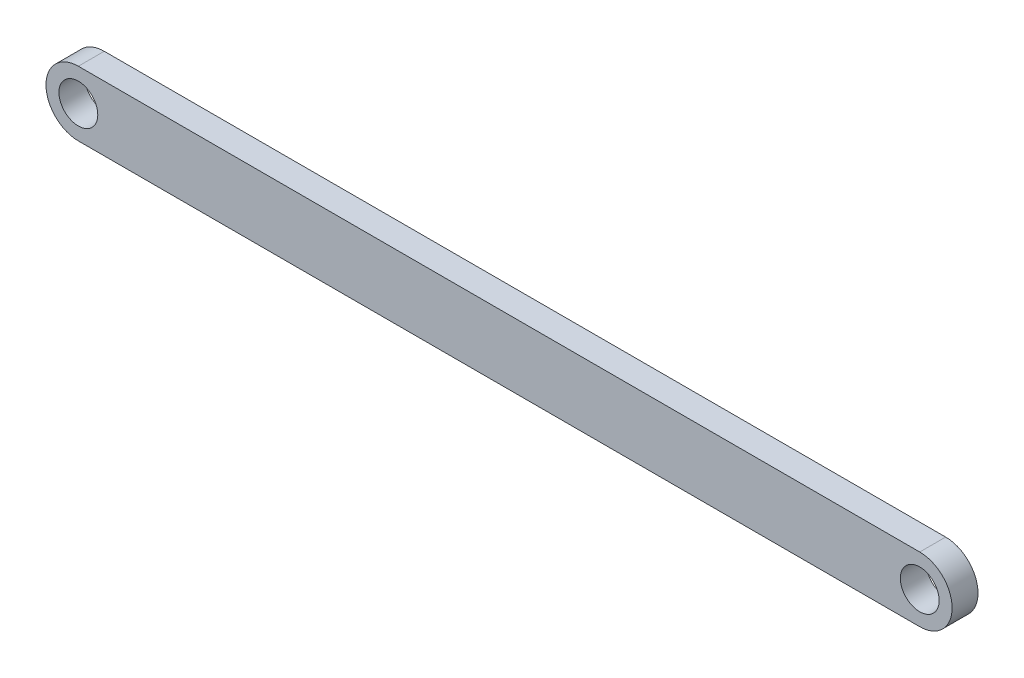
ISO-10303-21;
HEADER;
FILE_DESCRIPTION(('STEP AP214'),'2;1');
FILE_NAME('part.step','',(''),(''),'','','');
FILE_SCHEMA(('AUTOMOTIVE_DESIGN { 1 0 10303 214 1 1 1 1 }'));
ENDSEC;
DATA;
#1=APPLICATION_CONTEXT('core data for automotive mechanical design processes');
#2=APPLICATION_PROTOCOL_DEFINITION('international standard','automotive_design',2000,#1);
#3=PRODUCT_CONTEXT('',#1,'mechanical');
#4=PRODUCT('Part','Part','',(#3));
#5=PRODUCT_RELATED_PRODUCT_CATEGORY('part','',(#4));
#6=PRODUCT_DEFINITION_FORMATION('','',#4);
#7=PRODUCT_DEFINITION_CONTEXT('part definition',#1,'design');
#8=PRODUCT_DEFINITION('design','',#6,#7);
#9=PRODUCT_DEFINITION_SHAPE('','',#8);
#10=(LENGTH_UNIT() NAMED_UNIT(*) SI_UNIT(.MILLI.,.METRE.));
#11=(NAMED_UNIT(*) PLANE_ANGLE_UNIT() SI_UNIT($,.RADIAN.));
#12=(NAMED_UNIT(*) SI_UNIT($,.STERADIAN.) SOLID_ANGLE_UNIT());
#13=UNCERTAINTY_MEASURE_WITH_UNIT(LENGTH_MEASURE(1.E-05),#10,'distance_accuracy_value','');
#14=(GEOMETRIC_REPRESENTATION_CONTEXT(3) GLOBAL_UNCERTAINTY_ASSIGNED_CONTEXT((#13)) GLOBAL_UNIT_ASSIGNED_CONTEXT((#10,
#11,#12)) REPRESENTATION_CONTEXT('',''));
#15=CARTESIAN_POINT('',(0.,0.,0.));
#16=DIRECTION('',(0.,0.,1.));
#17=DIRECTION('',(1.,0.,0.));
#18=AXIS2_PLACEMENT_3D('',#15,#16,#17);
#19=CARTESIAN_POINT('',(0.,0.,2.));
#20=DIRECTION('',(0.,0.,1.));
#21=DIRECTION('',(1.,0.,0.));
#22=AXIS2_PLACEMENT_3D('',#19,#20,#21);
#23=PLANE('',#22);
#24=CARTESIAN_POINT('',(-65.,0.,2.));
#25=DIRECTION('',(0.,0.,1.));
#26=DIRECTION('',(1.,0.,0.));
#27=AXIS2_PLACEMENT_3D('',#24,#25,#26);
#28=CIRCLE('',#27,1.5);
#29=CARTESIAN_POINT('',(-63.5,0.,2.));
#30=VERTEX_POINT('',#29);
#31=EDGE_CURVE('E101',#30,#30,#28,.T.);
#32=ORIENTED_EDGE('',*,*,#31,.F.);
#33=EDGE_LOOP('',(#32));
#34=FACE_BOUND('',#33,.T.);
#35=CARTESIAN_POINT('',(0.,0.,2.));
#36=DIRECTION('',(0.,0.,1.));
#37=DIRECTION('',(1.,0.,0.));
#38=AXIS2_PLACEMENT_3D('',#35,#36,#37);
#39=CIRCLE('',#38,2.5);
#40=CARTESIAN_POINT('',(0.,-2.5,2.));
#41=VERTEX_POINT('',#40);
#42=CARTESIAN_POINT('',(0.,2.5,2.));
#43=VERTEX_POINT('',#42);
#44=EDGE_CURVE('E86',#41,#43,#39,.T.);
#45=ORIENTED_EDGE('',*,*,#44,.T.);
#46=DIRECTION('',(-1.,0.,0.));
#47=VECTOR('',#46,1.);
#48=CARTESIAN_POINT('',(0.,2.5,2.));
#49=LINE('',#48,#47);
#50=CARTESIAN_POINT('',(-65.,2.49999999999999,2.));
#51=VERTEX_POINT('',#50);
#52=EDGE_CURVE('E81',#43,#51,#49,.T.);
#53=ORIENTED_EDGE('',*,*,#52,.T.);
#54=CARTESIAN_POINT('',(-65.,0.,2.));
#55=DIRECTION('',(0.,0.,1.));
#56=DIRECTION('',(1.,0.,0.));
#57=AXIS2_PLACEMENT_3D('',#54,#55,#56);
#58=CIRCLE('',#57,2.5);
#59=CARTESIAN_POINT('',(-65.,-2.50000000000001,2.));
#60=VERTEX_POINT('',#59);
#61=EDGE_CURVE('E84',#51,#60,#58,.T.);
#62=ORIENTED_EDGE('',*,*,#61,.T.);
#63=DIRECTION('',(1.,0.,0.));
#64=VECTOR('',#63,1.);
#65=CARTESIAN_POINT('',(0.,-2.5,2.));
#66=LINE('',#65,#64);
#67=EDGE_CURVE('E51',#60,#41,#66,.T.);
#68=ORIENTED_EDGE('',*,*,#67,.T.);
#69=EDGE_LOOP('',(#45,#53,#62,#68));
#70=FACE_BOUND('',#69,.T.);
#71=CARTESIAN_POINT('',(0.,0.,2.));
#72=DIRECTION('',(0.,0.,1.));
#73=DIRECTION('',(1.,0.,0.));
#74=AXIS2_PLACEMENT_3D('',#71,#72,#73);
#75=CIRCLE('',#74,1.5);
#76=CARTESIAN_POINT('',(1.5,0.,2.));
#77=VERTEX_POINT('',#76);
#78=EDGE_CURVE('E116',#77,#77,#75,.T.);
#79=ORIENTED_EDGE('',*,*,#78,.F.);
#80=EDGE_LOOP('',(#79));
#81=FACE_BOUND('',#80,.T.);
#82=ADVANCED_FACE('F34',(#34,#70,#81),#23,.T.);
#83=CARTESIAN_POINT('',(0.,0.,0.));
#84=DIRECTION('',(0.,0.,1.));
#85=DIRECTION('',(1.,0.,0.));
#86=AXIS2_PLACEMENT_3D('',#83,#84,#85);
#87=PLANE('',#86);
#88=CARTESIAN_POINT('',(0.,0.,0.));
#89=DIRECTION('',(0.,0.,1.));
#90=DIRECTION('',(1.,0.,0.));
#91=AXIS2_PLACEMENT_3D('',#88,#89,#90);
#92=CIRCLE('',#91,2.5);
#93=CARTESIAN_POINT('',(0.,-2.5,0.));
#94=VERTEX_POINT('',#93);
#95=CARTESIAN_POINT('',(0.,2.5,0.));
#96=VERTEX_POINT('',#95);
#97=EDGE_CURVE('E98',#94,#96,#92,.T.);
#98=ORIENTED_EDGE('',*,*,#97,.F.);
#99=DIRECTION('',(1.,0.,0.));
#100=VECTOR('',#99,1.);
#101=CARTESIAN_POINT('',(0.,-2.5,0.));
#102=LINE('',#101,#100);
#103=CARTESIAN_POINT('',(-65.,-2.50000000000001,0.));
#104=VERTEX_POINT('',#103);
#105=EDGE_CURVE('E74',#104,#94,#102,.T.);
#106=ORIENTED_EDGE('',*,*,#105,.F.);
#107=CARTESIAN_POINT('',(-65.,0.,0.));
#108=DIRECTION('',(0.,0.,1.));
#109=DIRECTION('',(1.,0.,0.));
#110=AXIS2_PLACEMENT_3D('',#107,#108,#109);
#111=CIRCLE('',#110,2.5);
#112=CARTESIAN_POINT('',(-65.,2.49999999999999,0.));
#113=VERTEX_POINT('',#112);
#114=EDGE_CURVE('E68',#113,#104,#111,.T.);
#115=ORIENTED_EDGE('',*,*,#114,.F.);
#116=DIRECTION('',(-1.,0.,0.));
#117=VECTOR('',#116,1.);
#118=CARTESIAN_POINT('',(0.,2.5,0.));
#119=LINE('',#118,#117);
#120=EDGE_CURVE('E90',#96,#113,#119,.T.);
#121=ORIENTED_EDGE('',*,*,#120,.F.);
#122=EDGE_LOOP('',(#98,#106,#115,#121));
#123=FACE_BOUND('',#122,.T.);
#124=CARTESIAN_POINT('',(-65.,0.,0.));
#125=DIRECTION('',(0.,0.,1.));
#126=DIRECTION('',(1.,0.,0.));
#127=AXIS2_PLACEMENT_3D('',#124,#125,#126);
#128=CIRCLE('',#127,1.5);
#129=CARTESIAN_POINT('',(-63.5,0.,0.));
#130=VERTEX_POINT('',#129);
#131=EDGE_CURVE('E113',#130,#130,#128,.T.);
#132=ORIENTED_EDGE('',*,*,#131,.T.);
#133=EDGE_LOOP('',(#132));
#134=FACE_BOUND('',#133,.T.);
#135=CARTESIAN_POINT('',(0.,0.,0.));
#136=DIRECTION('',(0.,0.,1.));
#137=DIRECTION('',(1.,0.,0.));
#138=AXIS2_PLACEMENT_3D('',#135,#136,#137);
#139=CIRCLE('',#138,1.5);
#140=CARTESIAN_POINT('',(1.5,0.,0.));
#141=VERTEX_POINT('',#140);
#142=EDGE_CURVE('E119',#141,#141,#139,.T.);
#143=ORIENTED_EDGE('',*,*,#142,.T.);
#144=EDGE_LOOP('',(#143));
#145=FACE_BOUND('',#144,.T.);
#146=ADVANCED_FACE('F109',(#123,#134,#145),#87,.F.);
#147=CARTESIAN_POINT('',(0.,0.,2.));
#148=DIRECTION('',(0.,0.,-1.));
#149=DIRECTION('',(-1.,0.,0.));
#150=AXIS2_PLACEMENT_3D('',#147,#148,#149);
#151=CYLINDRICAL_SURFACE('',#150,2.5);
#152=ORIENTED_EDGE('',*,*,#97,.T.);
#153=DIRECTION('',(0.,0.,-1.));
#154=VECTOR('',#153,1.);
#155=CARTESIAN_POINT('',(0.,2.5,2.));
#156=LINE('',#155,#154);
#157=EDGE_CURVE('E11',#43,#96,#156,.T.);
#158=ORIENTED_EDGE('',*,*,#157,.F.);
#159=ORIENTED_EDGE('',*,*,#44,.F.);
#160=DIRECTION('',(0.,0.,-1.));
#161=VECTOR('',#160,1.);
#162=CARTESIAN_POINT('',(0.,-2.5,2.));
#163=LINE('',#162,#161);
#164=EDGE_CURVE('E94',#41,#94,#163,.T.);
#165=ORIENTED_EDGE('',*,*,#164,.T.);
#166=EDGE_LOOP('',(#152,#158,#159,#165));
#167=FACE_BOUND('',#166,.T.);
#168=ADVANCED_FACE('F36',(#167),#151,.T.);
#169=CARTESIAN_POINT('',(0.,2.5,2.));
#170=DIRECTION('',(0.,-1.,0.));
#171=DIRECTION('',(1.,0.,0.));
#172=AXIS2_PLACEMENT_3D('',#169,#170,#171);
#173=PLANE('',#172);
#174=ORIENTED_EDGE('',*,*,#120,.T.);
#175=DIRECTION('',(0.,0.,-1.));
#176=VECTOR('',#175,1.);
#177=CARTESIAN_POINT('',(-65.,2.49999999999999,2.));
#178=LINE('',#177,#176);
#179=EDGE_CURVE('E43',#51,#113,#178,.T.);
#180=ORIENTED_EDGE('',*,*,#179,.F.);
#181=ORIENTED_EDGE('',*,*,#52,.F.);
#182=ORIENTED_EDGE('',*,*,#157,.T.);
#183=EDGE_LOOP('',(#174,#180,#181,#182));
#184=FACE_BOUND('',#183,.T.);
#185=ADVANCED_FACE('F89',(#184),#173,.F.);
#186=CARTESIAN_POINT('',(-65.,0.,2.));
#187=DIRECTION('',(0.,0.,-1.));
#188=DIRECTION('',(-1.,0.,0.));
#189=AXIS2_PLACEMENT_3D('',#186,#187,#188);
#190=CYLINDRICAL_SURFACE('',#189,2.5);
#191=ORIENTED_EDGE('',*,*,#114,.T.);
#192=DIRECTION('',(0.,0.,-1.));
#193=VECTOR('',#192,1.);
#194=CARTESIAN_POINT('',(-65.,-2.50000000000001,2.));
#195=LINE('',#194,#193);
#196=EDGE_CURVE('E91',#60,#104,#195,.T.);
#197=ORIENTED_EDGE('',*,*,#196,.F.);
#198=ORIENTED_EDGE('',*,*,#61,.F.);
#199=ORIENTED_EDGE('',*,*,#179,.T.);
#200=EDGE_LOOP('',(#191,#197,#198,#199));
#201=FACE_BOUND('',#200,.T.);
#202=ADVANCED_FACE('F92',(#201),#190,.T.);
#203=CARTESIAN_POINT('',(0.,-2.5,2.));
#204=DIRECTION('',(0.,1.,0.));
#205=DIRECTION('',(-1.,0.,0.));
#206=AXIS2_PLACEMENT_3D('',#203,#204,#205);
#207=PLANE('',#206);
#208=ORIENTED_EDGE('',*,*,#105,.T.);
#209=ORIENTED_EDGE('',*,*,#164,.F.);
#210=ORIENTED_EDGE('',*,*,#67,.F.);
#211=ORIENTED_EDGE('',*,*,#196,.T.);
#212=EDGE_LOOP('',(#208,#209,#210,#211));
#213=FACE_BOUND('',#212,.T.);
#214=ADVANCED_FACE('F106',(#213),#207,.F.);
#215=CARTESIAN_POINT('',(-65.,0.,2.));
#216=DIRECTION('',(0.,0.,-1.));
#217=DIRECTION('',(-1.,0.,0.));
#218=AXIS2_PLACEMENT_3D('',#215,#216,#217);
#219=CYLINDRICAL_SURFACE('',#218,1.5);
#220=ORIENTED_EDGE('',*,*,#31,.T.);
#221=EDGE_LOOP('',(#220));
#222=FACE_BOUND('',#221,.T.);
#223=ORIENTED_EDGE('',*,*,#131,.F.);
#224=EDGE_LOOP('',(#223));
#225=FACE_BOUND('',#224,.T.);
#226=ADVANCED_FACE('F136',(#222,#225),#219,.F.);
#227=CARTESIAN_POINT('',(0.,0.,2.));
#228=DIRECTION('',(0.,0.,-1.));
#229=DIRECTION('',(-1.,0.,0.));
#230=AXIS2_PLACEMENT_3D('',#227,#228,#229);
#231=CYLINDRICAL_SURFACE('',#230,1.5);
#232=ORIENTED_EDGE('',*,*,#78,.T.);
#233=EDGE_LOOP('',(#232));
#234=FACE_BOUND('',#233,.T.);
#235=ORIENTED_EDGE('',*,*,#142,.F.);
#236=EDGE_LOOP('',(#235));
#237=FACE_BOUND('',#236,.T.);
#238=ADVANCED_FACE('F125',(#234,#237),#231,.F.);
#239=CLOSED_SHELL('',(#82,#146,#168,#185,#202,#214,#226,#238));
#240=MANIFOLD_SOLID_BREP('B2',#239);
#241=ADVANCED_BREP_SHAPE_REPRESENTATION('',(#18,#240),#14);
#242=SHAPE_DEFINITION_REPRESENTATION(#9,#241);
ENDSEC;
END-ISO-10303-21;
